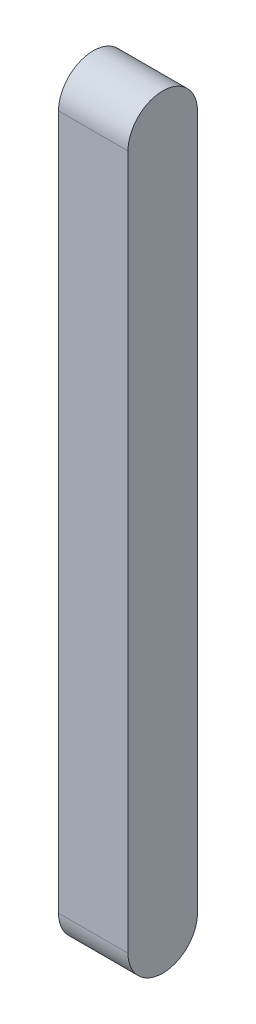
ISO-10303-21;
HEADER;
FILE_DESCRIPTION(('STEP AP214'),'2;1');
FILE_NAME('part.step','',(''),(''),'','','');
FILE_SCHEMA(('AUTOMOTIVE_DESIGN { 1 0 10303 214 1 1 1 1 }'));
ENDSEC;
DATA;
#1=APPLICATION_CONTEXT('core data for automotive mechanical design processes');
#2=APPLICATION_PROTOCOL_DEFINITION('international standard','automotive_design',2000,#1);
#3=PRODUCT_CONTEXT('',#1,'mechanical');
#4=PRODUCT('Part','Part','',(#3));
#5=PRODUCT_RELATED_PRODUCT_CATEGORY('part','',(#4));
#6=PRODUCT_DEFINITION_FORMATION('','',#4);
#7=PRODUCT_DEFINITION_CONTEXT('part definition',#1,'design');
#8=PRODUCT_DEFINITION('design','',#6,#7);
#9=PRODUCT_DEFINITION_SHAPE('','',#8);
#10=(LENGTH_UNIT() NAMED_UNIT(*) SI_UNIT(.MILLI.,.METRE.));
#11=(NAMED_UNIT(*) PLANE_ANGLE_UNIT() SI_UNIT($,.RADIAN.));
#12=(NAMED_UNIT(*) SI_UNIT($,.STERADIAN.) SOLID_ANGLE_UNIT());
#13=UNCERTAINTY_MEASURE_WITH_UNIT(LENGTH_MEASURE(1.E-05),#10,'distance_accuracy_value','');
#14=(GEOMETRIC_REPRESENTATION_CONTEXT(3) GLOBAL_UNCERTAINTY_ASSIGNED_CONTEXT((#13)) GLOBAL_UNIT_ASSIGNED_CONTEXT((#10,
#11,#12)) REPRESENTATION_CONTEXT('',''));
#15=CARTESIAN_POINT('',(0.,0.,0.));
#16=DIRECTION('',(0.,0.,1.));
#17=DIRECTION('',(1.,0.,0.));
#18=AXIS2_PLACEMENT_3D('',#15,#16,#17);
#19=CARTESIAN_POINT('',(66.7207207207207,-21.5720072840997,50.3961415614616));
#20=DIRECTION('',(-1.,0.,0.));
#21=DIRECTION('',(0.,0.,1.));
#22=AXIS2_PLACEMENT_3D('',#19,#20,#21);
#23=CYLINDRICAL_SURFACE('',#22,5.);
#24=CARTESIAN_POINT('',(56.7207207207207,-21.5720072840997,50.3961415614616));
#25=DIRECTION('',(1.,0.,0.));
#26=DIRECTION('',(0.,0.,-1.));
#27=AXIS2_PLACEMENT_3D('',#24,#25,#26);
#28=CIRCLE('',#27,5.);
#29=CARTESIAN_POINT('',(56.7207207207207,-21.5720072840997,45.3961415614616));
#30=VERTEX_POINT('',#29);
#31=CARTESIAN_POINT('',(56.7207207207207,-21.5720072840997,55.3961415614616));
#32=VERTEX_POINT('',#31);
#33=EDGE_CURVE('E95',#30,#32,#28,.T.);
#34=ORIENTED_EDGE('',*,*,#33,.T.);
#35=DIRECTION('',(-1.,0.,0.));
#36=VECTOR('',#35,1.);
#37=CARTESIAN_POINT('',(66.7207207207207,-21.5720072840997,55.3961415614616));
#38=LINE('',#37,#36);
#39=CARTESIAN_POINT('',(66.7207207207207,-21.5720072840997,55.3961415614616));
#40=VERTEX_POINT('',#39);
#41=EDGE_CURVE('E11',#40,#32,#38,.T.);
#42=ORIENTED_EDGE('',*,*,#41,.F.);
#43=CARTESIAN_POINT('',(66.7207207207207,-21.5720072840997,50.3961415614616));
#44=DIRECTION('',(1.,0.,0.));
#45=DIRECTION('',(0.,0.,-1.));
#46=AXIS2_PLACEMENT_3D('',#43,#44,#45);
#47=CIRCLE('',#46,5.);
#48=CARTESIAN_POINT('',(66.7207207207207,-21.5720072840997,45.3961415614616));
#49=VERTEX_POINT('',#48);
#50=EDGE_CURVE('E83',#49,#40,#47,.T.);
#51=ORIENTED_EDGE('',*,*,#50,.F.);
#52=DIRECTION('',(-1.,0.,0.));
#53=VECTOR('',#52,1.);
#54=CARTESIAN_POINT('',(66.7207207207207,-21.5720072840997,45.3961415614616));
#55=LINE('',#54,#53);
#56=EDGE_CURVE('E91',#49,#30,#55,.T.);
#57=ORIENTED_EDGE('',*,*,#56,.T.);
#58=EDGE_LOOP('',(#34,#42,#51,#57));
#59=FACE_BOUND('',#58,.T.);
#60=ADVANCED_FACE('F32',(#59),#23,.T.);
#61=CARTESIAN_POINT('',(66.7207207207207,-21.5720072840997,55.3961415614616));
#62=DIRECTION('',(0.,0.,-1.));
#63=DIRECTION('',(0.,1.,0.));
#64=AXIS2_PLACEMENT_3D('',#61,#62,#63);
#65=PLANE('',#64);
#66=DIRECTION('',(0.,-1.,0.));
#67=VECTOR('',#66,1.);
#68=CARTESIAN_POINT('',(56.7207207207207,-21.5720072840997,55.3961415614616));
#69=LINE('',#68,#67);
#70=CARTESIAN_POINT('',(56.7207207207207,-121.5720072841,55.3961415614616));
#71=VERTEX_POINT('',#70);
#72=EDGE_CURVE('E87',#32,#71,#69,.T.);
#73=ORIENTED_EDGE('',*,*,#72,.T.);
#74=DIRECTION('',(-1.,0.,0.));
#75=VECTOR('',#74,1.);
#76=CARTESIAN_POINT('',(66.7207207207207,-121.5720072841,55.3961415614616));
#77=LINE('',#76,#75);
#78=CARTESIAN_POINT('',(66.7207207207207,-121.5720072841,55.3961415614616));
#79=VERTEX_POINT('',#78);
#80=EDGE_CURVE('E40',#79,#71,#77,.T.);
#81=ORIENTED_EDGE('',*,*,#80,.F.);
#82=DIRECTION('',(0.,-1.,0.));
#83=VECTOR('',#82,1.);
#84=CARTESIAN_POINT('',(66.7207207207207,-21.5720072840997,55.3961415614616));
#85=LINE('',#84,#83);
#86=EDGE_CURVE('E78',#40,#79,#85,.T.);
#87=ORIENTED_EDGE('',*,*,#86,.F.);
#88=ORIENTED_EDGE('',*,*,#41,.T.);
#89=EDGE_LOOP('',(#73,#81,#87,#88));
#90=FACE_BOUND('',#89,.T.);
#91=ADVANCED_FACE('F86',(#90),#65,.F.);
#92=CARTESIAN_POINT('',(66.7207207207207,-121.5720072841,50.3961415614616));
#93=DIRECTION('',(-1.,0.,0.));
#94=DIRECTION('',(0.,0.,1.));
#95=AXIS2_PLACEMENT_3D('',#92,#93,#94);
#96=CYLINDRICAL_SURFACE('',#95,4.99999999999999);
#97=CARTESIAN_POINT('',(56.7207207207207,-121.5720072841,50.3961415614616));
#98=DIRECTION('',(1.,0.,0.));
#99=DIRECTION('',(0.,0.,1.));
#100=AXIS2_PLACEMENT_3D('',#97,#98,#99);
#101=CIRCLE('',#100,4.99999999999999);
#102=CARTESIAN_POINT('',(56.7207207207207,-121.5720072841,45.3961415614616));
#103=VERTEX_POINT('',#102);
#104=EDGE_CURVE('E65',#71,#103,#101,.T.);
#105=ORIENTED_EDGE('',*,*,#104,.T.);
#106=DIRECTION('',(-1.,0.,0.));
#107=VECTOR('',#106,1.);
#108=CARTESIAN_POINT('',(66.7207207207207,-121.5720072841,45.3961415614616));
#109=LINE('',#108,#107);
#110=CARTESIAN_POINT('',(66.7207207207207,-121.5720072841,45.3961415614616));
#111=VERTEX_POINT('',#110);
#112=EDGE_CURVE('E88',#111,#103,#109,.T.);
#113=ORIENTED_EDGE('',*,*,#112,.F.);
#114=CARTESIAN_POINT('',(66.7207207207207,-121.5720072841,50.3961415614616));
#115=DIRECTION('',(1.,0.,0.));
#116=DIRECTION('',(0.,0.,1.));
#117=AXIS2_PLACEMENT_3D('',#114,#115,#116);
#118=CIRCLE('',#117,4.99999999999999);
#119=EDGE_CURVE('E81',#79,#111,#118,.T.);
#120=ORIENTED_EDGE('',*,*,#119,.F.);
#121=ORIENTED_EDGE('',*,*,#80,.T.);
#122=EDGE_LOOP('',(#105,#113,#120,#121));
#123=FACE_BOUND('',#122,.T.);
#124=ADVANCED_FACE('F89',(#123),#96,.T.);
#125=CARTESIAN_POINT('',(66.7207207207207,-21.5720072840997,45.3961415614616));
#126=DIRECTION('',(0.,0.,1.));
#127=DIRECTION('',(1.,0.,0.));
#128=AXIS2_PLACEMENT_3D('',#125,#126,#127);
#129=PLANE('',#128);
#130=DIRECTION('',(0.,1.,0.));
#131=VECTOR('',#130,1.);
#132=CARTESIAN_POINT('',(56.7207207207207,-21.5720072840997,45.3961415614616));
#133=LINE('',#132,#131);
#134=EDGE_CURVE('E71',#103,#30,#133,.T.);
#135=ORIENTED_EDGE('',*,*,#134,.T.);
#136=ORIENTED_EDGE('',*,*,#56,.F.);
#137=DIRECTION('',(0.,1.,0.));
#138=VECTOR('',#137,1.);
#139=CARTESIAN_POINT('',(66.7207207207207,-21.5720072840997,45.3961415614616));
#140=LINE('',#139,#138);
#141=EDGE_CURVE('E48',#111,#49,#140,.T.);
#142=ORIENTED_EDGE('',*,*,#141,.F.);
#143=ORIENTED_EDGE('',*,*,#112,.T.);
#144=EDGE_LOOP('',(#135,#136,#142,#143));
#145=FACE_BOUND('',#144,.T.);
#146=ADVANCED_FACE('F102',(#145),#129,.F.);
#147=CARTESIAN_POINT('',(66.7207207207207,-21.5720072840997,50.3961415614616));
#148=DIRECTION('',(1.,0.,0.));
#149=DIRECTION('',(0.,0.,-1.));
#150=AXIS2_PLACEMENT_3D('',#147,#148,#149);
#151=PLANE('',#150);
#152=ORIENTED_EDGE('',*,*,#50,.T.);
#153=ORIENTED_EDGE('',*,*,#86,.T.);
#154=ORIENTED_EDGE('',*,*,#119,.T.);
#155=ORIENTED_EDGE('',*,*,#141,.T.);
#156=EDGE_LOOP('',(#152,#153,#154,#155));
#157=FACE_BOUND('',#156,.T.);
#158=ADVANCED_FACE('F79',(#157),#151,.T.);
#159=CARTESIAN_POINT('',(56.7207207207207,-21.5720072840997,50.3961415614616));
#160=DIRECTION('',(1.,0.,0.));
#161=DIRECTION('',(0.,0.,-1.));
#162=AXIS2_PLACEMENT_3D('',#159,#160,#161);
#163=PLANE('',#162);
#164=ORIENTED_EDGE('',*,*,#33,.F.);
#165=ORIENTED_EDGE('',*,*,#134,.F.);
#166=ORIENTED_EDGE('',*,*,#104,.F.);
#167=ORIENTED_EDGE('',*,*,#72,.F.);
#168=EDGE_LOOP('',(#164,#165,#166,#167));
#169=FACE_BOUND('',#168,.T.);
#170=ADVANCED_FACE('F105',(#169),#163,.F.);
#171=CLOSED_SHELL('',(#60,#91,#124,#146,#158,#170));
#172=MANIFOLD_SOLID_BREP('B2',#171);
#173=ADVANCED_BREP_SHAPE_REPRESENTATION('',(#18,#172),#14);
#174=SHAPE_DEFINITION_REPRESENTATION(#9,#173);
ENDSEC;
END-ISO-10303-21;
